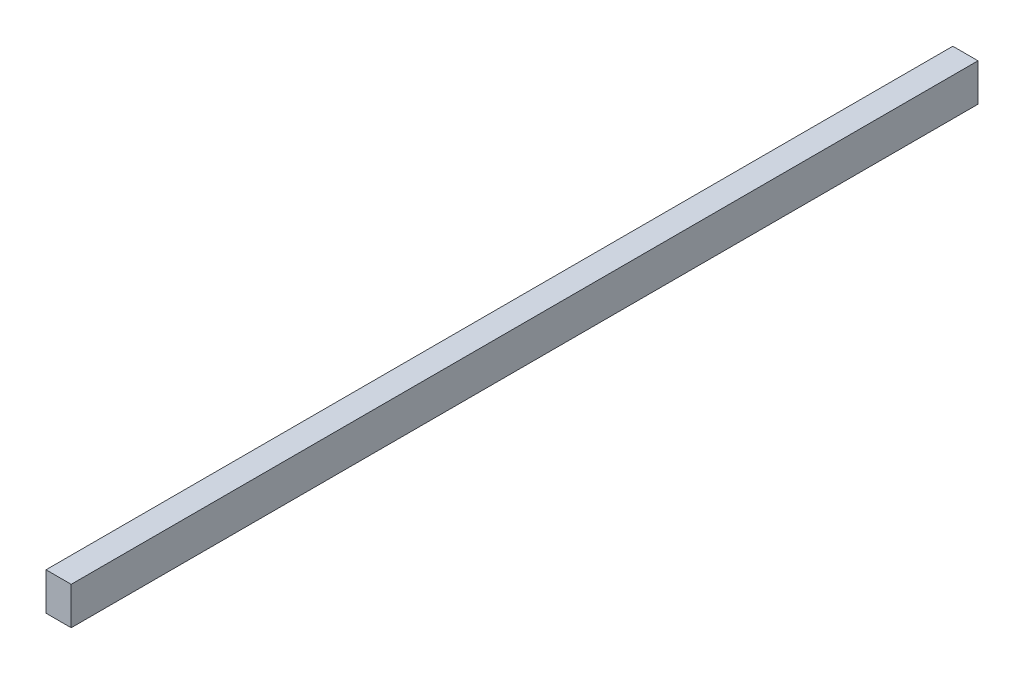
ISO-10303-21;
HEADER;
FILE_DESCRIPTION(('STEP AP214'),'2;1');
FILE_NAME('part.step','',(''),(''),'','','');
FILE_SCHEMA(('AUTOMOTIVE_DESIGN { 1 0 10303 214 1 1 1 1 }'));
ENDSEC;
DATA;
#1=APPLICATION_CONTEXT('core data for automotive mechanical design processes');
#2=APPLICATION_PROTOCOL_DEFINITION('international standard','automotive_design',2000,#1);
#3=PRODUCT_CONTEXT('',#1,'mechanical');
#4=PRODUCT('Part','Part','',(#3));
#5=PRODUCT_RELATED_PRODUCT_CATEGORY('part','',(#4));
#6=PRODUCT_DEFINITION_FORMATION('','',#4);
#7=PRODUCT_DEFINITION_CONTEXT('part definition',#1,'design');
#8=PRODUCT_DEFINITION('design','',#6,#7);
#9=PRODUCT_DEFINITION_SHAPE('','',#8);
#10=(LENGTH_UNIT() NAMED_UNIT(*) SI_UNIT(.MILLI.,.METRE.));
#11=(NAMED_UNIT(*) PLANE_ANGLE_UNIT() SI_UNIT($,.RADIAN.));
#12=(NAMED_UNIT(*) SI_UNIT($,.STERADIAN.) SOLID_ANGLE_UNIT());
#13=UNCERTAINTY_MEASURE_WITH_UNIT(LENGTH_MEASURE(1.E-05),#10,'distance_accuracy_value','');
#14=(GEOMETRIC_REPRESENTATION_CONTEXT(3) GLOBAL_UNCERTAINTY_ASSIGNED_CONTEXT((#13)) GLOBAL_UNIT_ASSIGNED_CONTEXT((#10,
#11,#12)) REPRESENTATION_CONTEXT('',''));
#15=CARTESIAN_POINT('',(0.,0.,0.));
#16=DIRECTION('',(0.,0.,1.));
#17=DIRECTION('',(1.,0.,0.));
#18=AXIS2_PLACEMENT_3D('',#15,#16,#17);
#19=CARTESIAN_POINT('',(200.059555583976,-148.537700895744,284.7119670539));
#20=DIRECTION('',(1.,0.,0.));
#21=DIRECTION('',(0.,1.,0.));
#22=AXIS2_PLACEMENT_3D('',#19,#20,#21);
#23=PLANE('',#22);
#24=DIRECTION('',(0.,0.,1.));
#25=VECTOR('',#24,1.);
#26=CARTESIAN_POINT('',(200.059555583976,-149.045793579175,284.7119670539));
#27=LINE('',#26,#25);
#28=CARTESIAN_POINT('',(200.059555583976,-149.045793579175,284.7119670539));
#29=VERTEX_POINT('',#28);
#30=CARTESIAN_POINT('',(200.059555583976,-149.045793579175,296.951975387089));
#31=VERTEX_POINT('',#30);
#32=EDGE_CURVE('E79',#29,#31,#27,.T.);
#33=ORIENTED_EDGE('',*,*,#32,.F.);
#34=DIRECTION('',(0.,-1.,0.));
#35=VECTOR('',#34,1.);
#36=CARTESIAN_POINT('',(200.059555583976,-148.537700895744,284.7119670539));
#37=LINE('',#36,#35);
#38=CARTESIAN_POINT('',(200.059555583976,-148.537700895744,284.7119670539));
#39=VERTEX_POINT('',#38);
#40=EDGE_CURVE('E32',#39,#29,#37,.T.);
#41=ORIENTED_EDGE('',*,*,#40,.F.);
#42=DIRECTION('',(0.,0.,1.));
#43=VECTOR('',#42,1.);
#44=CARTESIAN_POINT('',(200.059555583976,-148.537700895744,284.7119670539));
#45=LINE('',#44,#43);
#46=CARTESIAN_POINT('',(200.059555583976,-148.537700895744,296.951975387089));
#47=VERTEX_POINT('',#46);
#48=EDGE_CURVE('E71',#39,#47,#45,.T.);
#49=ORIENTED_EDGE('',*,*,#48,.T.);
#50=DIRECTION('',(0.,-1.,0.));
#51=VECTOR('',#50,1.);
#52=CARTESIAN_POINT('',(200.059555583976,-148.537700895744,296.951975387089));
#53=LINE('',#52,#51);
#54=EDGE_CURVE('E10',#47,#31,#53,.T.);
#55=ORIENTED_EDGE('',*,*,#54,.T.);
#56=EDGE_LOOP('',(#33,#41,#49,#55));
#57=FACE_BOUND('',#56,.T.);
#58=ADVANCED_FACE('F16',(#57),#23,.T.);
#59=CARTESIAN_POINT('',(200.059555583976,-148.537700895744,296.951975387089));
#60=DIRECTION('',(0.,0.,1.));
#61=DIRECTION('',(1.,0.,0.));
#62=AXIS2_PLACEMENT_3D('',#59,#60,#61);
#63=PLANE('',#62);
#64=DIRECTION('',(-1.,0.,0.));
#65=VECTOR('',#64,1.);
#66=CARTESIAN_POINT('',(200.059555583976,-149.045793579175,296.951975387089));
#67=LINE('',#66,#65);
#68=CARTESIAN_POINT('',(199.719547250787,-149.045793579175,296.951975387089));
#69=VERTEX_POINT('',#68);
#70=EDGE_CURVE('E82',#31,#69,#67,.T.);
#71=ORIENTED_EDGE('',*,*,#70,.F.);
#72=ORIENTED_EDGE('',*,*,#54,.F.);
#73=DIRECTION('',(-1.,0.,0.));
#74=VECTOR('',#73,1.);
#75=CARTESIAN_POINT('',(200.059555583976,-148.537700895744,296.951975387089));
#76=LINE('',#75,#74);
#77=CARTESIAN_POINT('',(199.719547250787,-148.537700895744,296.951975387089));
#78=VERTEX_POINT('',#77);
#79=EDGE_CURVE('E67',#47,#78,#76,.T.);
#80=ORIENTED_EDGE('',*,*,#79,.T.);
#81=DIRECTION('',(0.,-1.,0.));
#82=VECTOR('',#81,1.);
#83=CARTESIAN_POINT('',(199.719547250787,-148.537700895744,296.951975387089));
#84=LINE('',#83,#82);
#85=EDGE_CURVE('E24',#78,#69,#84,.T.);
#86=ORIENTED_EDGE('',*,*,#85,.T.);
#87=EDGE_LOOP('',(#71,#72,#80,#86));
#88=FACE_BOUND('',#87,.T.);
#89=ADVANCED_FACE('F68',(#88),#63,.T.);
#90=CARTESIAN_POINT('',(199.719547250787,-148.537700895744,296.951975387089));
#91=DIRECTION('',(-1.,0.,0.));
#92=DIRECTION('',(0.,-1.,0.));
#93=AXIS2_PLACEMENT_3D('',#90,#91,#92);
#94=PLANE('',#93);
#95=DIRECTION('',(0.,0.,-1.));
#96=VECTOR('',#95,1.);
#97=CARTESIAN_POINT('',(199.719547250787,-149.045793579175,296.951975387089));
#98=LINE('',#97,#96);
#99=CARTESIAN_POINT('',(199.719547250787,-149.045793579175,284.7119670539));
#100=VERTEX_POINT('',#99);
#101=EDGE_CURVE('E65',#69,#100,#98,.T.);
#102=ORIENTED_EDGE('',*,*,#101,.F.);
#103=ORIENTED_EDGE('',*,*,#85,.F.);
#104=DIRECTION('',(0.,0.,-1.));
#105=VECTOR('',#104,1.);
#106=CARTESIAN_POINT('',(199.719547250787,-148.537700895744,296.951975387089));
#107=LINE('',#106,#105);
#108=CARTESIAN_POINT('',(199.719547250787,-148.537700895744,284.7119670539));
#109=VERTEX_POINT('',#108);
#110=EDGE_CURVE('E62',#78,#109,#107,.T.);
#111=ORIENTED_EDGE('',*,*,#110,.T.);
#112=DIRECTION('',(0.,-1.,0.));
#113=VECTOR('',#112,1.);
#114=CARTESIAN_POINT('',(199.719547250787,-148.537700895744,284.7119670539));
#115=LINE('',#114,#113);
#116=EDGE_CURVE('E48',#109,#100,#115,.T.);
#117=ORIENTED_EDGE('',*,*,#116,.T.);
#118=EDGE_LOOP('',(#102,#103,#111,#117));
#119=FACE_BOUND('',#118,.T.);
#120=ADVANCED_FACE('F60',(#119),#94,.T.);
#121=CARTESIAN_POINT('',(199.719547250787,-148.537700895744,284.7119670539));
#122=DIRECTION('',(0.,0.,-1.));
#123=DIRECTION('',(-1.,0.,0.));
#124=AXIS2_PLACEMENT_3D('',#121,#122,#123);
#125=PLANE('',#124);
#126=DIRECTION('',(1.,0.,0.));
#127=VECTOR('',#126,1.);
#128=CARTESIAN_POINT('',(199.719547250787,-149.045793579175,284.7119670539));
#129=LINE('',#128,#127);
#130=EDGE_CURVE('E85',#100,#29,#129,.T.);
#131=ORIENTED_EDGE('',*,*,#130,.F.);
#132=ORIENTED_EDGE('',*,*,#116,.F.);
#133=DIRECTION('',(1.,0.,0.));
#134=VECTOR('',#133,1.);
#135=CARTESIAN_POINT('',(199.719547250787,-148.537700895744,284.7119670539));
#136=LINE('',#135,#134);
#137=EDGE_CURVE('E74',#109,#39,#136,.T.);
#138=ORIENTED_EDGE('',*,*,#137,.T.);
#139=ORIENTED_EDGE('',*,*,#40,.T.);
#140=EDGE_LOOP('',(#131,#132,#138,#139));
#141=FACE_BOUND('',#140,.T.);
#142=ADVANCED_FACE('F96',(#141),#125,.T.);
#143=CARTESIAN_POINT('',(206.339551417382,-148.537700895744,290.831971220494));
#144=DIRECTION('',(0.,-1.,0.));
#145=DIRECTION('',(1.,0.,0.));
#146=AXIS2_PLACEMENT_3D('',#143,#144,#145);
#147=PLANE('',#146);
#148=ORIENTED_EDGE('',*,*,#48,.F.);
#149=ORIENTED_EDGE('',*,*,#137,.F.);
#150=ORIENTED_EDGE('',*,*,#110,.F.);
#151=ORIENTED_EDGE('',*,*,#79,.F.);
#152=EDGE_LOOP('',(#148,#149,#150,#151));
#153=FACE_BOUND('',#152,.T.);
#154=ADVANCED_FACE('F73',(#153),#147,.F.);
#155=CARTESIAN_POINT('',(206.339551417382,-149.045793579175,290.831971220494));
#156=DIRECTION('',(0.,-1.,0.));
#157=DIRECTION('',(1.,0.,0.));
#158=AXIS2_PLACEMENT_3D('',#155,#156,#157);
#159=PLANE('',#158);
#160=ORIENTED_EDGE('',*,*,#32,.T.);
#161=ORIENTED_EDGE('',*,*,#70,.T.);
#162=ORIENTED_EDGE('',*,*,#101,.T.);
#163=ORIENTED_EDGE('',*,*,#130,.T.);
#164=EDGE_LOOP('',(#160,#161,#162,#163));
#165=FACE_BOUND('',#164,.T.);
#166=ADVANCED_FACE('F89',(#165),#159,.T.);
#167=CLOSED_SHELL('',(#58,#89,#120,#142,#154,#166));
#168=MANIFOLD_SOLID_BREP('B1',#167);
#169=ADVANCED_BREP_SHAPE_REPRESENTATION('',(#18,#168),#14);
#170=SHAPE_DEFINITION_REPRESENTATION(#9,#169);
ENDSEC;
END-ISO-10303-21;
